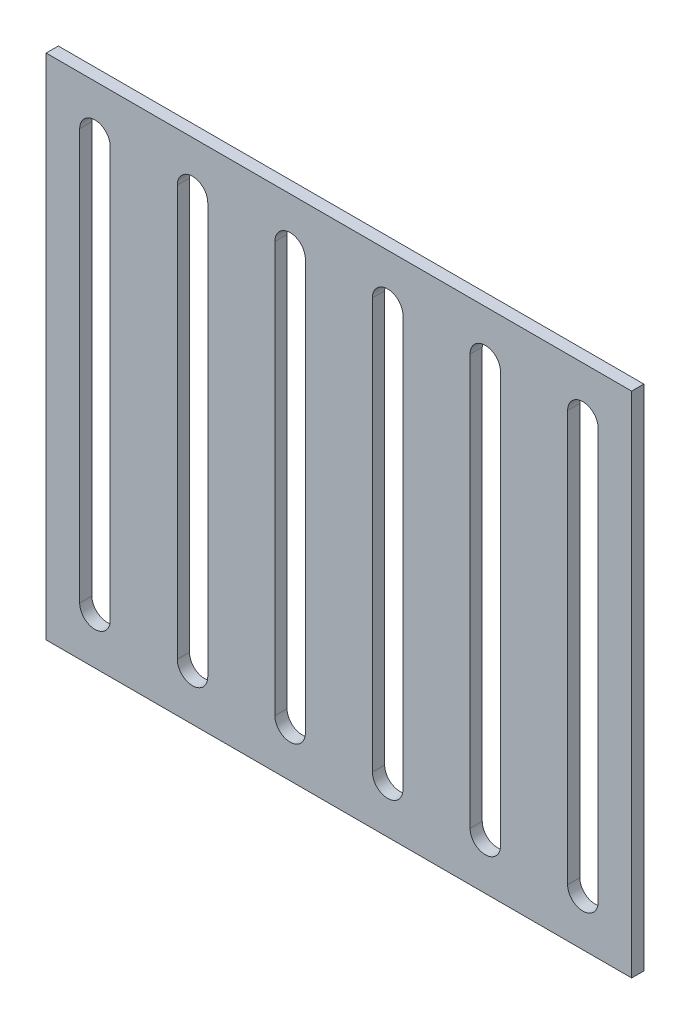
ISO-10303-21;
HEADER;
FILE_DESCRIPTION(('STEP AP214'),'2;1');
FILE_NAME('part.step','',(''),(''),'','','');
FILE_SCHEMA(('AUTOMOTIVE_DESIGN { 1 0 10303 214 1 1 1 1 }'));
ENDSEC;
DATA;
#1=APPLICATION_CONTEXT('core data for automotive mechanical design processes');
#2=APPLICATION_PROTOCOL_DEFINITION('international standard','automotive_design',2000,#1);
#3=PRODUCT_CONTEXT('',#1,'mechanical');
#4=PRODUCT('Part','Part','',(#3));
#5=PRODUCT_RELATED_PRODUCT_CATEGORY('part','',(#4));
#6=PRODUCT_DEFINITION_FORMATION('','',#4);
#7=PRODUCT_DEFINITION_CONTEXT('part definition',#1,'design');
#8=PRODUCT_DEFINITION('design','',#6,#7);
#9=PRODUCT_DEFINITION_SHAPE('','',#8);
#10=(LENGTH_UNIT() NAMED_UNIT(*) SI_UNIT(.MILLI.,.METRE.));
#11=(NAMED_UNIT(*) PLANE_ANGLE_UNIT() SI_UNIT($,.RADIAN.));
#12=(NAMED_UNIT(*) SI_UNIT($,.STERADIAN.) SOLID_ANGLE_UNIT());
#13=UNCERTAINTY_MEASURE_WITH_UNIT(LENGTH_MEASURE(1.E-05),#10,'distance_accuracy_value','');
#14=(GEOMETRIC_REPRESENTATION_CONTEXT(3) GLOBAL_UNCERTAINTY_ASSIGNED_CONTEXT((#13)) GLOBAL_UNIT_ASSIGNED_CONTEXT((#10,
#11,#12)) REPRESENTATION_CONTEXT('',''));
#15=CARTESIAN_POINT('',(0.,0.,0.));
#16=DIRECTION('',(0.,0.,1.));
#17=DIRECTION('',(1.,0.,0.));
#18=AXIS2_PLACEMENT_3D('',#15,#16,#17);
#19=CARTESIAN_POINT('',(271.5,24.,0.));
#20=DIRECTION('',(1.,0.,0.));
#21=DIRECTION('',(0.,1.,0.));
#22=AXIS2_PLACEMENT_3D('',#19,#20,#21);
#23=PLANE('',#22);
#24=DIRECTION('',(0.,1.,0.));
#25=VECTOR('',#24,1.);
#26=CARTESIAN_POINT('',(271.5,24.,6.));
#27=LINE('',#26,#25);
#28=CARTESIAN_POINT('',(271.5,24.,6.));
#29=VERTEX_POINT('',#28);
#30=CARTESIAN_POINT('',(271.5,226.,6.));
#31=VERTEX_POINT('',#30);
#32=EDGE_CURVE('E431',#29,#31,#27,.T.);
#33=ORIENTED_EDGE('',*,*,#32,.T.);
#34=DIRECTION('',(0.,0.,1.));
#35=VECTOR('',#34,1.);
#36=CARTESIAN_POINT('',(271.5,226.,0.));
#37=LINE('',#36,#35);
#38=CARTESIAN_POINT('',(271.5,226.,0.));
#39=VERTEX_POINT('',#38);
#40=EDGE_CURVE('E11',#39,#31,#37,.T.);
#41=ORIENTED_EDGE('',*,*,#40,.F.);
#42=DIRECTION('',(0.,1.,0.));
#43=VECTOR('',#42,1.);
#44=CARTESIAN_POINT('',(271.5,24.,0.));
#45=LINE('',#44,#43);
#46=CARTESIAN_POINT('',(271.5,24.,0.));
#47=VERTEX_POINT('',#46);
#48=EDGE_CURVE('E435',#47,#39,#45,.T.);
#49=ORIENTED_EDGE('',*,*,#48,.F.);
#50=DIRECTION('',(0.,0.,1.));
#51=VECTOR('',#50,1.);
#52=CARTESIAN_POINT('',(271.5,24.,0.));
#53=LINE('',#52,#51);
#54=EDGE_CURVE('E440',#47,#29,#53,.T.);
#55=ORIENTED_EDGE('',*,*,#54,.T.);
#56=EDGE_LOOP('',(#33,#41,#49,#55));
#57=FACE_BOUND('',#56,.T.);
#58=ADVANCED_FACE('F38',(#57),#23,.F.);
#59=CARTESIAN_POINT('',(264.,226.,0.));
#60=DIRECTION('',(0.,0.,1.));
#61=DIRECTION('',(1.,0.,0.));
#62=AXIS2_PLACEMENT_3D('',#59,#60,#61);
#63=CYLINDRICAL_SURFACE('',#62,7.5);
#64=CARTESIAN_POINT('',(264.,226.,6.));
#65=DIRECTION('',(0.,0.,1.));
#66=DIRECTION('',(1.,0.,0.));
#67=AXIS2_PLACEMENT_3D('',#64,#65,#66);
#68=CIRCLE('',#67,7.5);
#69=CARTESIAN_POINT('',(256.5,226.,6.));
#70=VERTEX_POINT('',#69);
#71=EDGE_CURVE('E428',#31,#70,#68,.T.);
#72=ORIENTED_EDGE('',*,*,#71,.T.);
#73=DIRECTION('',(0.,0.,1.));
#74=VECTOR('',#73,1.);
#75=CARTESIAN_POINT('',(256.5,226.,0.));
#76=LINE('',#75,#74);
#77=CARTESIAN_POINT('',(256.5,226.,0.));
#78=VERTEX_POINT('',#77);
#79=EDGE_CURVE('E45',#78,#70,#76,.T.);
#80=ORIENTED_EDGE('',*,*,#79,.F.);
#81=CARTESIAN_POINT('',(264.,226.,0.));
#82=DIRECTION('',(0.,0.,1.));
#83=DIRECTION('',(1.,0.,0.));
#84=AXIS2_PLACEMENT_3D('',#81,#82,#83);
#85=CIRCLE('',#84,7.5);
#86=EDGE_CURVE('E59',#39,#78,#85,.T.);
#87=ORIENTED_EDGE('',*,*,#86,.F.);
#88=ORIENTED_EDGE('',*,*,#40,.T.);
#89=EDGE_LOOP('',(#72,#80,#87,#88));
#90=FACE_BOUND('',#89,.T.);
#91=ADVANCED_FACE('F450',(#90),#63,.F.);
#92=CARTESIAN_POINT('',(256.5,24.,0.));
#93=DIRECTION('',(-1.,0.,0.));
#94=DIRECTION('',(0.,-1.,0.));
#95=AXIS2_PLACEMENT_3D('',#92,#93,#94);
#96=PLANE('',#95);
#97=DIRECTION('',(0.,-1.,0.));
#98=VECTOR('',#97,1.);
#99=CARTESIAN_POINT('',(256.5,24.,6.));
#100=LINE('',#99,#98);
#101=CARTESIAN_POINT('',(256.5,24.,6.));
#102=VERTEX_POINT('',#101);
#103=EDGE_CURVE('E425',#70,#102,#100,.T.);
#104=ORIENTED_EDGE('',*,*,#103,.T.);
#105=DIRECTION('',(0.,0.,1.));
#106=VECTOR('',#105,1.);
#107=CARTESIAN_POINT('',(256.5,24.,0.));
#108=LINE('',#107,#106);
#109=CARTESIAN_POINT('',(256.5,24.,0.));
#110=VERTEX_POINT('',#109);
#111=EDGE_CURVE('E443',#110,#102,#108,.T.);
#112=ORIENTED_EDGE('',*,*,#111,.F.);
#113=DIRECTION('',(0.,-1.,0.));
#114=VECTOR('',#113,1.);
#115=CARTESIAN_POINT('',(256.5,24.,0.));
#116=LINE('',#115,#114);
#117=EDGE_CURVE('E438',#78,#110,#116,.T.);
#118=ORIENTED_EDGE('',*,*,#117,.F.);
#119=ORIENTED_EDGE('',*,*,#79,.T.);
#120=EDGE_LOOP('',(#104,#112,#118,#119));
#121=FACE_BOUND('',#120,.T.);
#122=ADVANCED_FACE('F447',(#121),#96,.F.);
#123=CARTESIAN_POINT('',(264.,24.,0.));
#124=DIRECTION('',(0.,0.,1.));
#125=DIRECTION('',(1.,0.,0.));
#126=AXIS2_PLACEMENT_3D('',#123,#124,#125);
#127=CYLINDRICAL_SURFACE('',#126,7.50000000000003);
#128=CARTESIAN_POINT('',(264.,24.,6.));
#129=DIRECTION('',(0.,0.,1.));
#130=DIRECTION('',(1.,0.,0.));
#131=AXIS2_PLACEMENT_3D('',#128,#129,#130);
#132=CIRCLE('',#131,7.50000000000003);
#133=EDGE_CURVE('E423',#102,#29,#132,.T.);
#134=ORIENTED_EDGE('',*,*,#133,.T.);
#135=ORIENTED_EDGE('',*,*,#54,.F.);
#136=CARTESIAN_POINT('',(264.,24.,0.));
#137=DIRECTION('',(0.,0.,1.));
#138=DIRECTION('',(1.,0.,0.));
#139=AXIS2_PLACEMENT_3D('',#136,#137,#138);
#140=CIRCLE('',#139,7.50000000000003);
#141=EDGE_CURVE('E52',#110,#47,#140,.T.);
#142=ORIENTED_EDGE('',*,*,#141,.F.);
#143=ORIENTED_EDGE('',*,*,#111,.T.);
#144=EDGE_LOOP('',(#134,#135,#142,#143));
#145=FACE_BOUND('',#144,.T.);
#146=ADVANCED_FACE('F456',(#145),#127,.F.);
#147=CARTESIAN_POINT('',(223.5,24.,0.));
#148=DIRECTION('',(1.,0.,0.));
#149=DIRECTION('',(0.,1.,0.));
#150=AXIS2_PLACEMENT_3D('',#147,#148,#149);
#151=PLANE('',#150);
#152=DIRECTION('',(0.,1.,0.));
#153=VECTOR('',#152,1.);
#154=CARTESIAN_POINT('',(223.5,24.,6.));
#155=LINE('',#154,#153);
#156=CARTESIAN_POINT('',(223.5,24.,6.));
#157=VERTEX_POINT('',#156);
#158=CARTESIAN_POINT('',(223.5,226.,6.));
#159=VERTEX_POINT('',#158);
#160=EDGE_CURVE('E399',#157,#159,#155,.T.);
#161=ORIENTED_EDGE('',*,*,#160,.T.);
#162=DIRECTION('',(0.,0.,1.));
#163=VECTOR('',#162,1.);
#164=CARTESIAN_POINT('',(223.5,226.,0.));
#165=LINE('',#164,#163);
#166=CARTESIAN_POINT('',(223.5,226.,0.));
#167=VERTEX_POINT('',#166);
#168=EDGE_CURVE('E420',#167,#159,#165,.T.);
#169=ORIENTED_EDGE('',*,*,#168,.F.);
#170=DIRECTION('',(0.,1.,0.));
#171=VECTOR('',#170,1.);
#172=CARTESIAN_POINT('',(223.5,24.,0.));
#173=LINE('',#172,#171);
#174=CARTESIAN_POINT('',(223.5,24.,0.));
#175=VERTEX_POINT('',#174);
#176=EDGE_CURVE('E404',#175,#167,#173,.T.);
#177=ORIENTED_EDGE('',*,*,#176,.F.);
#178=DIRECTION('',(0.,0.,1.));
#179=VECTOR('',#178,1.);
#180=CARTESIAN_POINT('',(223.5,24.,0.));
#181=LINE('',#180,#179);
#182=EDGE_CURVE('E411',#175,#157,#181,.T.);
#183=ORIENTED_EDGE('',*,*,#182,.T.);
#184=EDGE_LOOP('',(#161,#169,#177,#183));
#185=FACE_BOUND('',#184,.T.);
#186=ADVANCED_FACE('F458',(#185),#151,.F.);
#187=CARTESIAN_POINT('',(216.,226.,0.));
#188=DIRECTION('',(0.,0.,1.));
#189=DIRECTION('',(1.,0.,0.));
#190=AXIS2_PLACEMENT_3D('',#187,#188,#189);
#191=CYLINDRICAL_SURFACE('',#190,7.5);
#192=CARTESIAN_POINT('',(216.,226.,6.));
#193=DIRECTION('',(0.,0.,1.));
#194=DIRECTION('',(1.,0.,0.));
#195=AXIS2_PLACEMENT_3D('',#192,#193,#194);
#196=CIRCLE('',#195,7.5);
#197=CARTESIAN_POINT('',(208.5,226.,6.));
#198=VERTEX_POINT('',#197);
#199=EDGE_CURVE('E396',#159,#198,#196,.T.);
#200=ORIENTED_EDGE('',*,*,#199,.T.);
#201=DIRECTION('',(0.,0.,1.));
#202=VECTOR('',#201,1.);
#203=CARTESIAN_POINT('',(208.5,226.,0.));
#204=LINE('',#203,#202);
#205=CARTESIAN_POINT('',(208.5,226.,0.));
#206=VERTEX_POINT('',#205);
#207=EDGE_CURVE('E417',#206,#198,#204,.T.);
#208=ORIENTED_EDGE('',*,*,#207,.F.);
#209=CARTESIAN_POINT('',(216.,226.,0.));
#210=DIRECTION('',(0.,0.,1.));
#211=DIRECTION('',(1.,0.,0.));
#212=AXIS2_PLACEMENT_3D('',#209,#210,#211);
#213=CIRCLE('',#212,7.5);
#214=EDGE_CURVE('E406',#167,#206,#213,.T.);
#215=ORIENTED_EDGE('',*,*,#214,.F.);
#216=ORIENTED_EDGE('',*,*,#168,.T.);
#217=EDGE_LOOP('',(#200,#208,#215,#216));
#218=FACE_BOUND('',#217,.T.);
#219=ADVANCED_FACE('F464',(#218),#191,.F.);
#220=CARTESIAN_POINT('',(208.5,24.,0.));
#221=DIRECTION('',(-1.,0.,0.));
#222=DIRECTION('',(0.,-1.,0.));
#223=AXIS2_PLACEMENT_3D('',#220,#221,#222);
#224=PLANE('',#223);
#225=DIRECTION('',(0.,-1.,0.));
#226=VECTOR('',#225,1.);
#227=CARTESIAN_POINT('',(208.5,24.,6.));
#228=LINE('',#227,#226);
#229=CARTESIAN_POINT('',(208.5,24.,6.));
#230=VERTEX_POINT('',#229);
#231=EDGE_CURVE('E393',#198,#230,#228,.T.);
#232=ORIENTED_EDGE('',*,*,#231,.T.);
#233=DIRECTION('',(0.,0.,1.));
#234=VECTOR('',#233,1.);
#235=CARTESIAN_POINT('',(208.5,24.,0.));
#236=LINE('',#235,#234);
#237=CARTESIAN_POINT('',(208.5,24.,0.));
#238=VERTEX_POINT('',#237);
#239=EDGE_CURVE('E414',#238,#230,#236,.T.);
#240=ORIENTED_EDGE('',*,*,#239,.F.);
#241=DIRECTION('',(0.,-1.,0.));
#242=VECTOR('',#241,1.);
#243=CARTESIAN_POINT('',(208.5,24.,0.));
#244=LINE('',#243,#242);
#245=EDGE_CURVE('E408',#206,#238,#244,.T.);
#246=ORIENTED_EDGE('',*,*,#245,.F.);
#247=ORIENTED_EDGE('',*,*,#207,.T.);
#248=EDGE_LOOP('',(#232,#240,#246,#247));
#249=FACE_BOUND('',#248,.T.);
#250=ADVANCED_FACE('F611',(#249),#224,.F.);
#251=CARTESIAN_POINT('',(216.,24.,0.));
#252=DIRECTION('',(0.,0.,1.));
#253=DIRECTION('',(1.,0.,0.));
#254=AXIS2_PLACEMENT_3D('',#251,#252,#253);
#255=CYLINDRICAL_SURFACE('',#254,7.50000000000003);
#256=CARTESIAN_POINT('',(216.,24.,6.));
#257=DIRECTION('',(0.,0.,1.));
#258=DIRECTION('',(1.,0.,0.));
#259=AXIS2_PLACEMENT_3D('',#256,#257,#258);
#260=CIRCLE('',#259,7.50000000000003);
#261=EDGE_CURVE('E391',#230,#157,#260,.T.);
#262=ORIENTED_EDGE('',*,*,#261,.T.);
#263=ORIENTED_EDGE('',*,*,#182,.F.);
#264=CARTESIAN_POINT('',(216.,24.,0.));
#265=DIRECTION('',(0.,0.,1.));
#266=DIRECTION('',(1.,0.,0.));
#267=AXIS2_PLACEMENT_3D('',#264,#265,#266);
#268=CIRCLE('',#267,7.50000000000003);
#269=EDGE_CURVE('E402',#238,#175,#268,.T.);
#270=ORIENTED_EDGE('',*,*,#269,.F.);
#271=ORIENTED_EDGE('',*,*,#239,.T.);
#272=EDGE_LOOP('',(#262,#263,#270,#271));
#273=FACE_BOUND('',#272,.T.);
#274=ADVANCED_FACE('F485',(#273),#255,.F.);
#275=CARTESIAN_POINT('',(175.5,24.,0.));
#276=DIRECTION('',(1.,0.,0.));
#277=DIRECTION('',(0.,1.,0.));
#278=AXIS2_PLACEMENT_3D('',#275,#276,#277);
#279=PLANE('',#278);
#280=DIRECTION('',(0.,1.,0.));
#281=VECTOR('',#280,1.);
#282=CARTESIAN_POINT('',(175.5,24.,6.));
#283=LINE('',#282,#281);
#284=CARTESIAN_POINT('',(175.5,24.,6.));
#285=VERTEX_POINT('',#284);
#286=CARTESIAN_POINT('',(175.5,226.,6.));
#287=VERTEX_POINT('',#286);
#288=EDGE_CURVE('E367',#285,#287,#283,.T.);
#289=ORIENTED_EDGE('',*,*,#288,.T.);
#290=DIRECTION('',(0.,0.,1.));
#291=VECTOR('',#290,1.);
#292=CARTESIAN_POINT('',(175.5,226.,0.));
#293=LINE('',#292,#291);
#294=CARTESIAN_POINT('',(175.5,226.,0.));
#295=VERTEX_POINT('',#294);
#296=EDGE_CURVE('E388',#295,#287,#293,.T.);
#297=ORIENTED_EDGE('',*,*,#296,.F.);
#298=DIRECTION('',(0.,1.,0.));
#299=VECTOR('',#298,1.);
#300=CARTESIAN_POINT('',(175.5,24.,0.));
#301=LINE('',#300,#299);
#302=CARTESIAN_POINT('',(175.5,24.,0.));
#303=VERTEX_POINT('',#302);
#304=EDGE_CURVE('E372',#303,#295,#301,.T.);
#305=ORIENTED_EDGE('',*,*,#304,.F.);
#306=DIRECTION('',(0.,0.,1.));
#307=VECTOR('',#306,1.);
#308=CARTESIAN_POINT('',(175.5,24.,0.));
#309=LINE('',#308,#307);
#310=EDGE_CURVE('E379',#303,#285,#309,.T.);
#311=ORIENTED_EDGE('',*,*,#310,.T.);
#312=EDGE_LOOP('',(#289,#297,#305,#311));
#313=FACE_BOUND('',#312,.T.);
#314=ADVANCED_FACE('F597',(#313),#279,.F.);
#315=CARTESIAN_POINT('',(168.,226.,0.));
#316=DIRECTION('',(0.,0.,1.));
#317=DIRECTION('',(1.,0.,0.));
#318=AXIS2_PLACEMENT_3D('',#315,#316,#317);
#319=CYLINDRICAL_SURFACE('',#318,7.5);
#320=CARTESIAN_POINT('',(168.,226.,6.));
#321=DIRECTION('',(0.,0.,1.));
#322=DIRECTION('',(1.,0.,0.));
#323=AXIS2_PLACEMENT_3D('',#320,#321,#322);
#324=CIRCLE('',#323,7.5);
#325=CARTESIAN_POINT('',(160.5,226.,6.));
#326=VERTEX_POINT('',#325);
#327=EDGE_CURVE('E364',#287,#326,#324,.T.);
#328=ORIENTED_EDGE('',*,*,#327,.T.);
#329=DIRECTION('',(0.,0.,1.));
#330=VECTOR('',#329,1.);
#331=CARTESIAN_POINT('',(160.5,226.,0.));
#332=LINE('',#331,#330);
#333=CARTESIAN_POINT('',(160.5,226.,0.));
#334=VERTEX_POINT('',#333);
#335=EDGE_CURVE('E385',#334,#326,#332,.T.);
#336=ORIENTED_EDGE('',*,*,#335,.F.);
#337=CARTESIAN_POINT('',(168.,226.,0.));
#338=DIRECTION('',(0.,0.,1.));
#339=DIRECTION('',(1.,0.,0.));
#340=AXIS2_PLACEMENT_3D('',#337,#338,#339);
#341=CIRCLE('',#340,7.5);
#342=EDGE_CURVE('E374',#295,#334,#341,.T.);
#343=ORIENTED_EDGE('',*,*,#342,.F.);
#344=ORIENTED_EDGE('',*,*,#296,.T.);
#345=EDGE_LOOP('',(#328,#336,#343,#344));
#346=FACE_BOUND('',#345,.T.);
#347=ADVANCED_FACE('F590',(#346),#319,.F.);
#348=CARTESIAN_POINT('',(160.5,24.,0.));
#349=DIRECTION('',(-1.,0.,0.));
#350=DIRECTION('',(0.,-1.,0.));
#351=AXIS2_PLACEMENT_3D('',#348,#349,#350);
#352=PLANE('',#351);
#353=DIRECTION('',(0.,-1.,0.));
#354=VECTOR('',#353,1.);
#355=CARTESIAN_POINT('',(160.5,24.,6.));
#356=LINE('',#355,#354);
#357=CARTESIAN_POINT('',(160.5,24.,6.));
#358=VERTEX_POINT('',#357);
#359=EDGE_CURVE('E361',#326,#358,#356,.T.);
#360=ORIENTED_EDGE('',*,*,#359,.T.);
#361=DIRECTION('',(0.,0.,1.));
#362=VECTOR('',#361,1.);
#363=CARTESIAN_POINT('',(160.5,24.,0.));
#364=LINE('',#363,#362);
#365=CARTESIAN_POINT('',(160.5,24.,0.));
#366=VERTEX_POINT('',#365);
#367=EDGE_CURVE('E382',#366,#358,#364,.T.);
#368=ORIENTED_EDGE('',*,*,#367,.F.);
#369=DIRECTION('',(0.,-1.,0.));
#370=VECTOR('',#369,1.);
#371=CARTESIAN_POINT('',(160.5,24.,0.));
#372=LINE('',#371,#370);
#373=EDGE_CURVE('E376',#334,#366,#372,.T.);
#374=ORIENTED_EDGE('',*,*,#373,.F.);
#375=ORIENTED_EDGE('',*,*,#335,.T.);
#376=EDGE_LOOP('',(#360,#368,#374,#375));
#377=FACE_BOUND('',#376,.T.);
#378=ADVANCED_FACE('F583',(#377),#352,.F.);
#379=CARTESIAN_POINT('',(168.,24.,0.));
#380=DIRECTION('',(0.,0.,1.));
#381=DIRECTION('',(1.,0.,0.));
#382=AXIS2_PLACEMENT_3D('',#379,#380,#381);
#383=CYLINDRICAL_SURFACE('',#382,7.50000000000003);
#384=CARTESIAN_POINT('',(168.,24.,6.));
#385=DIRECTION('',(0.,0.,1.));
#386=DIRECTION('',(1.,0.,0.));
#387=AXIS2_PLACEMENT_3D('',#384,#385,#386);
#388=CIRCLE('',#387,7.50000000000003);
#389=EDGE_CURVE('E359',#358,#285,#388,.T.);
#390=ORIENTED_EDGE('',*,*,#389,.T.);
#391=ORIENTED_EDGE('',*,*,#310,.F.);
#392=CARTESIAN_POINT('',(168.,24.,0.));
#393=DIRECTION('',(0.,0.,1.));
#394=DIRECTION('',(1.,0.,0.));
#395=AXIS2_PLACEMENT_3D('',#392,#393,#394);
#396=CIRCLE('',#395,7.50000000000003);
#397=EDGE_CURVE('E370',#366,#303,#396,.T.);
#398=ORIENTED_EDGE('',*,*,#397,.F.);
#399=ORIENTED_EDGE('',*,*,#367,.T.);
#400=EDGE_LOOP('',(#390,#391,#398,#399));
#401=FACE_BOUND('',#400,.T.);
#402=ADVANCED_FACE('F574',(#401),#383,.F.);
#403=CARTESIAN_POINT('',(127.5,24.,0.));
#404=DIRECTION('',(1.,0.,0.));
#405=DIRECTION('',(0.,1.,0.));
#406=AXIS2_PLACEMENT_3D('',#403,#404,#405);
#407=PLANE('',#406);
#408=DIRECTION('',(0.,1.,0.));
#409=VECTOR('',#408,1.);
#410=CARTESIAN_POINT('',(127.5,24.,6.));
#411=LINE('',#410,#409);
#412=CARTESIAN_POINT('',(127.5,24.,6.));
#413=VERTEX_POINT('',#412);
#414=CARTESIAN_POINT('',(127.5,226.,6.));
#415=VERTEX_POINT('',#414);
#416=EDGE_CURVE('E335',#413,#415,#411,.T.);
#417=ORIENTED_EDGE('',*,*,#416,.T.);
#418=DIRECTION('',(0.,0.,1.));
#419=VECTOR('',#418,1.);
#420=CARTESIAN_POINT('',(127.5,226.,0.));
#421=LINE('',#420,#419);
#422=CARTESIAN_POINT('',(127.5,226.,0.));
#423=VERTEX_POINT('',#422);
#424=EDGE_CURVE('E356',#423,#415,#421,.T.);
#425=ORIENTED_EDGE('',*,*,#424,.F.);
#426=DIRECTION('',(0.,1.,0.));
#427=VECTOR('',#426,1.);
#428=CARTESIAN_POINT('',(127.5,24.,0.));
#429=LINE('',#428,#427);
#430=CARTESIAN_POINT('',(127.5,24.,0.));
#431=VERTEX_POINT('',#430);
#432=EDGE_CURVE('E340',#431,#423,#429,.T.);
#433=ORIENTED_EDGE('',*,*,#432,.F.);
#434=DIRECTION('',(0.,0.,1.));
#435=VECTOR('',#434,1.);
#436=CARTESIAN_POINT('',(127.5,24.,0.));
#437=LINE('',#436,#435);
#438=EDGE_CURVE('E347',#431,#413,#437,.T.);
#439=ORIENTED_EDGE('',*,*,#438,.T.);
#440=EDGE_LOOP('',(#417,#425,#433,#439));
#441=FACE_BOUND('',#440,.T.);
#442=ADVANCED_FACE('F565',(#441),#407,.F.);
#443=CARTESIAN_POINT('',(120.,226.,0.));
#444=DIRECTION('',(0.,0.,1.));
#445=DIRECTION('',(1.,0.,0.));
#446=AXIS2_PLACEMENT_3D('',#443,#444,#445);
#447=CYLINDRICAL_SURFACE('',#446,7.5);
#448=CARTESIAN_POINT('',(120.,226.,6.));
#449=DIRECTION('',(0.,0.,1.));
#450=DIRECTION('',(1.,0.,0.));
#451=AXIS2_PLACEMENT_3D('',#448,#449,#450);
#452=CIRCLE('',#451,7.5);
#453=CARTESIAN_POINT('',(112.5,226.,6.));
#454=VERTEX_POINT('',#453);
#455=EDGE_CURVE('E332',#415,#454,#452,.T.);
#456=ORIENTED_EDGE('',*,*,#455,.T.);
#457=DIRECTION('',(0.,0.,1.));
#458=VECTOR('',#457,1.);
#459=CARTESIAN_POINT('',(112.5,226.,0.));
#460=LINE('',#459,#458);
#461=CARTESIAN_POINT('',(112.5,226.,0.));
#462=VERTEX_POINT('',#461);
#463=EDGE_CURVE('E353',#462,#454,#460,.T.);
#464=ORIENTED_EDGE('',*,*,#463,.F.);
#465=CARTESIAN_POINT('',(120.,226.,0.));
#466=DIRECTION('',(0.,0.,1.));
#467=DIRECTION('',(1.,0.,0.));
#468=AXIS2_PLACEMENT_3D('',#465,#466,#467);
#469=CIRCLE('',#468,7.5);
#470=EDGE_CURVE('E342',#423,#462,#469,.T.);
#471=ORIENTED_EDGE('',*,*,#470,.F.);
#472=ORIENTED_EDGE('',*,*,#424,.T.);
#473=EDGE_LOOP('',(#456,#464,#471,#472));
#474=FACE_BOUND('',#473,.T.);
#475=ADVANCED_FACE('F555',(#474),#447,.F.);
#476=CARTESIAN_POINT('',(112.5,24.,0.));
#477=DIRECTION('',(-1.,0.,0.));
#478=DIRECTION('',(0.,-1.,0.));
#479=AXIS2_PLACEMENT_3D('',#476,#477,#478);
#480=PLANE('',#479);
#481=DIRECTION('',(0.,-1.,0.));
#482=VECTOR('',#481,1.);
#483=CARTESIAN_POINT('',(112.5,24.,6.));
#484=LINE('',#483,#482);
#485=CARTESIAN_POINT('',(112.5,24.,6.));
#486=VERTEX_POINT('',#485);
#487=EDGE_CURVE('E329',#454,#486,#484,.T.);
#488=ORIENTED_EDGE('',*,*,#487,.T.);
#489=DIRECTION('',(0.,0.,1.));
#490=VECTOR('',#489,1.);
#491=CARTESIAN_POINT('',(112.5,24.,0.));
#492=LINE('',#491,#490);
#493=CARTESIAN_POINT('',(112.5,24.,0.));
#494=VERTEX_POINT('',#493);
#495=EDGE_CURVE('E350',#494,#486,#492,.T.);
#496=ORIENTED_EDGE('',*,*,#495,.F.);
#497=DIRECTION('',(0.,-1.,0.));
#498=VECTOR('',#497,1.);
#499=CARTESIAN_POINT('',(112.5,24.,0.));
#500=LINE('',#499,#498);
#501=EDGE_CURVE('E344',#462,#494,#500,.T.);
#502=ORIENTED_EDGE('',*,*,#501,.F.);
#503=ORIENTED_EDGE('',*,*,#463,.T.);
#504=EDGE_LOOP('',(#488,#496,#502,#503));
#505=FACE_BOUND('',#504,.T.);
#506=ADVANCED_FACE('F546',(#505),#480,.F.);
#507=CARTESIAN_POINT('',(120.,24.,0.));
#508=DIRECTION('',(0.,0.,1.));
#509=DIRECTION('',(1.,0.,0.));
#510=AXIS2_PLACEMENT_3D('',#507,#508,#509);
#511=CYLINDRICAL_SURFACE('',#510,7.50000000000003);
#512=CARTESIAN_POINT('',(120.,24.,6.));
#513=DIRECTION('',(0.,0.,1.));
#514=DIRECTION('',(1.,0.,0.));
#515=AXIS2_PLACEMENT_3D('',#512,#513,#514);
#516=CIRCLE('',#515,7.50000000000003);
#517=EDGE_CURVE('E327',#486,#413,#516,.T.);
#518=ORIENTED_EDGE('',*,*,#517,.T.);
#519=ORIENTED_EDGE('',*,*,#438,.F.);
#520=CARTESIAN_POINT('',(120.,24.,0.));
#521=DIRECTION('',(0.,0.,1.));
#522=DIRECTION('',(1.,0.,0.));
#523=AXIS2_PLACEMENT_3D('',#520,#521,#522);
#524=CIRCLE('',#523,7.50000000000003);
#525=EDGE_CURVE('E338',#494,#431,#524,.T.);
#526=ORIENTED_EDGE('',*,*,#525,.F.);
#527=ORIENTED_EDGE('',*,*,#495,.T.);
#528=EDGE_LOOP('',(#518,#519,#526,#527));
#529=FACE_BOUND('',#528,.T.);
#530=ADVANCED_FACE('F538',(#529),#511,.F.);
#531=CARTESIAN_POINT('',(0.,0.,6.));
#532=DIRECTION('',(1.,0.,0.));
#533=DIRECTION('',(0.,0.,-1.));
#534=AXIS2_PLACEMENT_3D('',#531,#532,#533);
#535=PLANE('',#534);
#536=DIRECTION('',(0.,-1.,0.));
#537=VECTOR('',#536,1.);
#538=CARTESIAN_POINT('',(0.,0.,0.));
#539=LINE('',#538,#537);
#540=CARTESIAN_POINT('',(0.,250.,0.));
#541=VERTEX_POINT('',#540);
#542=CARTESIAN_POINT('',(0.,0.,0.));
#543=VERTEX_POINT('',#542);
#544=EDGE_CURVE('E291',#541,#543,#539,.T.);
#545=ORIENTED_EDGE('',*,*,#544,.T.);
#546=DIRECTION('',(0.,0.,-1.));
#547=VECTOR('',#546,1.);
#548=CARTESIAN_POINT('',(0.,0.,6.));
#549=LINE('',#548,#547);
#550=CARTESIAN_POINT('',(0.,0.,6.));
#551=VERTEX_POINT('',#550);
#552=EDGE_CURVE('E324',#551,#543,#549,.T.);
#553=ORIENTED_EDGE('',*,*,#552,.F.);
#554=DIRECTION('',(0.,-1.,0.));
#555=VECTOR('',#554,1.);
#556=CARTESIAN_POINT('',(0.,0.,6.));
#557=LINE('',#556,#555);
#558=CARTESIAN_POINT('',(0.,250.,6.));
#559=VERTEX_POINT('',#558);
#560=EDGE_CURVE('E298',#559,#551,#557,.T.);
#561=ORIENTED_EDGE('',*,*,#560,.F.);
#562=DIRECTION('',(0.,0.,-1.));
#563=VECTOR('',#562,1.);
#564=CARTESIAN_POINT('',(0.,250.,6.));
#565=LINE('',#564,#563);
#566=EDGE_CURVE('E308',#559,#541,#565,.T.);
#567=ORIENTED_EDGE('',*,*,#566,.T.);
#568=EDGE_LOOP('',(#545,#553,#561,#567));
#569=FACE_BOUND('',#568,.T.);
#570=ADVANCED_FACE('F530',(#569),#535,.F.);
#571=CARTESIAN_POINT('',(0.,0.,6.));
#572=DIRECTION('',(0.,1.,0.));
#573=DIRECTION('',(0.,0.,1.));
#574=AXIS2_PLACEMENT_3D('',#571,#572,#573);
#575=PLANE('',#574);
#576=DIRECTION('',(1.,0.,0.));
#577=VECTOR('',#576,1.);
#578=CARTESIAN_POINT('',(0.,0.,0.));
#579=LINE('',#578,#577);
#580=CARTESIAN_POINT('',(288.,0.,0.));
#581=VERTEX_POINT('',#580);
#582=EDGE_CURVE('E311',#543,#581,#579,.T.);
#583=ORIENTED_EDGE('',*,*,#582,.T.);
#584=DIRECTION('',(0.,0.,-1.));
#585=VECTOR('',#584,1.);
#586=CARTESIAN_POINT('',(288.,0.,6.));
#587=LINE('',#586,#585);
#588=CARTESIAN_POINT('',(288.,0.,6.));
#589=VERTEX_POINT('',#588);
#590=EDGE_CURVE('E321',#589,#581,#587,.T.);
#591=ORIENTED_EDGE('',*,*,#590,.F.);
#592=DIRECTION('',(1.,0.,0.));
#593=VECTOR('',#592,1.);
#594=CARTESIAN_POINT('',(0.,0.,6.));
#595=LINE('',#594,#593);
#596=EDGE_CURVE('E301',#551,#589,#595,.T.);
#597=ORIENTED_EDGE('',*,*,#596,.F.);
#598=ORIENTED_EDGE('',*,*,#552,.T.);
#599=EDGE_LOOP('',(#583,#591,#597,#598));
#600=FACE_BOUND('',#599,.T.);
#601=ADVANCED_FACE('F522',(#600),#575,.F.);
#602=CARTESIAN_POINT('',(288.,0.,6.));
#603=DIRECTION('',(-1.,0.,0.));
#604=DIRECTION('',(0.,0.,1.));
#605=AXIS2_PLACEMENT_3D('',#602,#603,#604);
#606=PLANE('',#605);
#607=DIRECTION('',(0.,1.,0.));
#608=VECTOR('',#607,1.);
#609=CARTESIAN_POINT('',(288.,0.,0.));
#610=LINE('',#609,#608);
#611=CARTESIAN_POINT('',(288.,250.,0.));
#612=VERTEX_POINT('',#611);
#613=EDGE_CURVE('E313',#581,#612,#610,.T.);
#614=ORIENTED_EDGE('',*,*,#613,.T.);
#615=DIRECTION('',(0.,0.,-1.));
#616=VECTOR('',#615,1.);
#617=CARTESIAN_POINT('',(288.,250.,6.));
#618=LINE('',#617,#616);
#619=CARTESIAN_POINT('',(288.,250.,6.));
#620=VERTEX_POINT('',#619);
#621=EDGE_CURVE('E318',#620,#612,#618,.T.);
#622=ORIENTED_EDGE('',*,*,#621,.F.);
#623=DIRECTION('',(0.,1.,0.));
#624=VECTOR('',#623,1.);
#625=CARTESIAN_POINT('',(288.,0.,6.));
#626=LINE('',#625,#624);
#627=EDGE_CURVE('E304',#589,#620,#626,.T.);
#628=ORIENTED_EDGE('',*,*,#627,.F.);
#629=ORIENTED_EDGE('',*,*,#590,.T.);
#630=EDGE_LOOP('',(#614,#622,#628,#629));
#631=FACE_BOUND('',#630,.T.);
#632=ADVANCED_FACE('F511',(#631),#606,.F.);
#633=CARTESIAN_POINT('',(0.,250.,6.));
#634=DIRECTION('',(0.,-1.,0.));
#635=DIRECTION('',(0.,0.,-1.));
#636=AXIS2_PLACEMENT_3D('',#633,#634,#635);
#637=PLANE('',#636);
#638=DIRECTION('',(-1.,0.,0.));
#639=VECTOR('',#638,1.);
#640=CARTESIAN_POINT('',(0.,250.,0.));
#641=LINE('',#640,#639);
#642=EDGE_CURVE('E302',#612,#541,#641,.T.);
#643=ORIENTED_EDGE('',*,*,#642,.T.);
#644=ORIENTED_EDGE('',*,*,#566,.F.);
#645=DIRECTION('',(-1.,0.,0.));
#646=VECTOR('',#645,1.);
#647=CARTESIAN_POINT('',(0.,250.,6.));
#648=LINE('',#647,#646);
#649=EDGE_CURVE('E306',#620,#559,#648,.T.);
#650=ORIENTED_EDGE('',*,*,#649,.F.);
#651=ORIENTED_EDGE('',*,*,#621,.T.);
#652=EDGE_LOOP('',(#643,#644,#650,#651));
#653=FACE_BOUND('',#652,.T.);
#654=ADVANCED_FACE('F500',(#653),#637,.F.);
#655=CARTESIAN_POINT('',(0.,0.,6.));
#656=DIRECTION('',(0.,0.,-1.));
#657=DIRECTION('',(-1.,0.,0.));
#658=AXIS2_PLACEMENT_3D('',#655,#656,#657);
#659=PLANE('',#658);
#660=DIRECTION('',(0.,1.,0.));
#661=VECTOR('',#660,1.);
#662=CARTESIAN_POINT('',(79.5,24.,6.));
#663=LINE('',#662,#661);
#664=CARTESIAN_POINT('',(79.5,24.,6.));
#665=VERTEX_POINT('',#664);
#666=CARTESIAN_POINT('',(79.5,226.,6.));
#667=VERTEX_POINT('',#666);
#668=EDGE_CURVE('E224',#665,#667,#663,.T.);
#669=ORIENTED_EDGE('',*,*,#668,.F.);
#670=CARTESIAN_POINT('',(72.,24.,6.));
#671=DIRECTION('',(0.,0.,1.));
#672=DIRECTION('',(1.,0.,0.));
#673=AXIS2_PLACEMENT_3D('',#670,#671,#672);
#674=CIRCLE('',#673,7.50000000000003);
#675=CARTESIAN_POINT('',(64.5,24.,6.));
#676=VERTEX_POINT('',#675);
#677=EDGE_CURVE('E260',#676,#665,#674,.T.);
#678=ORIENTED_EDGE('',*,*,#677,.F.);
#679=DIRECTION('',(0.,-1.,0.));
#680=VECTOR('',#679,1.);
#681=CARTESIAN_POINT('',(64.5,24.,6.));
#682=LINE('',#681,#680);
#683=CARTESIAN_POINT('',(64.5,226.,6.));
#684=VERTEX_POINT('',#683);
#685=EDGE_CURVE('E246',#684,#676,#682,.T.);
#686=ORIENTED_EDGE('',*,*,#685,.F.);
#687=CARTESIAN_POINT('',(72.,226.,6.));
#688=DIRECTION('',(0.,0.,1.));
#689=DIRECTION('',(1.,0.,0.));
#690=AXIS2_PLACEMENT_3D('',#687,#688,#689);
#691=CIRCLE('',#690,7.5);
#692=EDGE_CURVE('E238',#667,#684,#691,.T.);
#693=ORIENTED_EDGE('',*,*,#692,.F.);
#694=EDGE_LOOP('',(#669,#678,#686,#693));
#695=FACE_BOUND('',#694,.T.);
#696=DIRECTION('',(0.,1.,0.));
#697=VECTOR('',#696,1.);
#698=CARTESIAN_POINT('',(31.5,24.,6.));
#699=LINE('',#698,#697);
#700=CARTESIAN_POINT('',(31.5,24.,6.));
#701=VERTEX_POINT('',#700);
#702=CARTESIAN_POINT('',(31.5,226.,6.));
#703=VERTEX_POINT('',#702);
#704=EDGE_CURVE('E281',#701,#703,#699,.T.);
#705=ORIENTED_EDGE('',*,*,#704,.F.);
#706=CARTESIAN_POINT('',(24.,24.,6.));
#707=DIRECTION('',(0.,0.,1.));
#708=DIRECTION('',(1.,0.,0.));
#709=AXIS2_PLACEMENT_3D('',#706,#707,#708);
#710=CIRCLE('',#709,7.50000000000003);
#711=CARTESIAN_POINT('',(16.5,24.,6.));
#712=VERTEX_POINT('',#711);
#713=EDGE_CURVE('E265',#712,#701,#710,.T.);
#714=ORIENTED_EDGE('',*,*,#713,.F.);
#715=DIRECTION('',(0.,-1.,0.));
#716=VECTOR('',#715,1.);
#717=CARTESIAN_POINT('',(16.5,24.,6.));
#718=LINE('',#717,#716);
#719=CARTESIAN_POINT('',(16.5,226.,6.));
#720=VERTEX_POINT('',#719);
#721=EDGE_CURVE('E270',#720,#712,#718,.T.);
#722=ORIENTED_EDGE('',*,*,#721,.F.);
#723=CARTESIAN_POINT('',(24.,226.,6.));
#724=DIRECTION('',(0.,0.,1.));
#725=DIRECTION('',(1.,0.,0.));
#726=AXIS2_PLACEMENT_3D('',#723,#724,#725);
#727=CIRCLE('',#726,7.5);
#728=EDGE_CURVE('E284',#703,#720,#727,.T.);
#729=ORIENTED_EDGE('',*,*,#728,.F.);
#730=EDGE_LOOP('',(#705,#714,#722,#729));
#731=FACE_BOUND('',#730,.T.);
#732=ORIENTED_EDGE('',*,*,#560,.T.);
#733=ORIENTED_EDGE('',*,*,#596,.T.);
#734=ORIENTED_EDGE('',*,*,#627,.T.);
#735=ORIENTED_EDGE('',*,*,#649,.T.);
#736=EDGE_LOOP('',(#732,#733,#734,#735));
#737=FACE_BOUND('',#736,.T.);
#738=ORIENTED_EDGE('',*,*,#517,.F.);
#739=ORIENTED_EDGE('',*,*,#487,.F.);
#740=ORIENTED_EDGE('',*,*,#455,.F.);
#741=ORIENTED_EDGE('',*,*,#416,.F.);
#742=EDGE_LOOP('',(#738,#739,#740,#741));
#743=FACE_BOUND('',#742,.T.);
#744=ORIENTED_EDGE('',*,*,#389,.F.);
#745=ORIENTED_EDGE('',*,*,#359,.F.);
#746=ORIENTED_EDGE('',*,*,#327,.F.);
#747=ORIENTED_EDGE('',*,*,#288,.F.);
#748=EDGE_LOOP('',(#744,#745,#746,#747));
#749=FACE_BOUND('',#748,.T.);
#750=ORIENTED_EDGE('',*,*,#261,.F.);
#751=ORIENTED_EDGE('',*,*,#231,.F.);
#752=ORIENTED_EDGE('',*,*,#199,.F.);
#753=ORIENTED_EDGE('',*,*,#160,.F.);
#754=EDGE_LOOP('',(#750,#751,#752,#753));
#755=FACE_BOUND('',#754,.T.);
#756=ORIENTED_EDGE('',*,*,#133,.F.);
#757=ORIENTED_EDGE('',*,*,#103,.F.);
#758=ORIENTED_EDGE('',*,*,#71,.F.);
#759=ORIENTED_EDGE('',*,*,#32,.F.);
#760=EDGE_LOOP('',(#756,#757,#758,#759));
#761=FACE_BOUND('',#760,.T.);
#762=ADVANCED_FACE('F244',(#695,#731,#737,#743,#749,#755,#761),#659,.F.);
#763=CARTESIAN_POINT('',(0.,0.,0.));
#764=DIRECTION('',(0.,0.,-1.));
#765=DIRECTION('',(-1.,0.,0.));
#766=AXIS2_PLACEMENT_3D('',#763,#764,#765);
#767=PLANE('',#766);
#768=CARTESIAN_POINT('',(72.,24.,0.));
#769=DIRECTION('',(0.,0.,1.));
#770=DIRECTION('',(1.,0.,0.));
#771=AXIS2_PLACEMENT_3D('',#768,#769,#770);
#772=CIRCLE('',#771,7.50000000000003);
#773=CARTESIAN_POINT('',(64.5,24.,0.));
#774=VERTEX_POINT('',#773);
#775=CARTESIAN_POINT('',(79.5,24.,0.));
#776=VERTEX_POINT('',#775);
#777=EDGE_CURVE('E262',#774,#776,#772,.T.);
#778=ORIENTED_EDGE('',*,*,#777,.T.);
#779=DIRECTION('',(0.,1.,0.));
#780=VECTOR('',#779,1.);
#781=CARTESIAN_POINT('',(79.5,24.,0.));
#782=LINE('',#781,#780);
#783=CARTESIAN_POINT('',(79.5,226.,0.));
#784=VERTEX_POINT('',#783);
#785=EDGE_CURVE('E234',#776,#784,#782,.T.);
#786=ORIENTED_EDGE('',*,*,#785,.T.);
#787=CARTESIAN_POINT('',(72.,226.,0.));
#788=DIRECTION('',(0.,0.,1.));
#789=DIRECTION('',(1.,0.,0.));
#790=AXIS2_PLACEMENT_3D('',#787,#788,#789);
#791=CIRCLE('',#790,7.5);
#792=CARTESIAN_POINT('',(64.5,226.,0.));
#793=VERTEX_POINT('',#792);
#794=EDGE_CURVE('E241',#784,#793,#791,.T.);
#795=ORIENTED_EDGE('',*,*,#794,.T.);
#796=DIRECTION('',(0.,-1.,0.));
#797=VECTOR('',#796,1.);
#798=CARTESIAN_POINT('',(64.5,24.,0.));
#799=LINE('',#798,#797);
#800=EDGE_CURVE('E257',#793,#774,#799,.T.);
#801=ORIENTED_EDGE('',*,*,#800,.T.);
#802=EDGE_LOOP('',(#778,#786,#795,#801));
#803=FACE_BOUND('',#802,.T.);
#804=CARTESIAN_POINT('',(24.,24.,0.));
#805=DIRECTION('',(0.,0.,1.));
#806=DIRECTION('',(1.,0.,0.));
#807=AXIS2_PLACEMENT_3D('',#804,#805,#806);
#808=CIRCLE('',#807,7.50000000000003);
#809=CARTESIAN_POINT('',(16.5,24.,0.));
#810=VERTEX_POINT('',#809);
#811=CARTESIAN_POINT('',(31.5,24.,0.));
#812=VERTEX_POINT('',#811);
#813=EDGE_CURVE('E266',#810,#812,#808,.T.);
#814=ORIENTED_EDGE('',*,*,#813,.T.);
#815=DIRECTION('',(0.,1.,0.));
#816=VECTOR('',#815,1.);
#817=CARTESIAN_POINT('',(31.5,24.,0.));
#818=LINE('',#817,#816);
#819=CARTESIAN_POINT('',(31.5,226.,0.));
#820=VERTEX_POINT('',#819);
#821=EDGE_CURVE('E269',#812,#820,#818,.T.);
#822=ORIENTED_EDGE('',*,*,#821,.T.);
#823=CARTESIAN_POINT('',(24.,226.,0.));
#824=DIRECTION('',(0.,0.,1.));
#825=DIRECTION('',(1.,0.,0.));
#826=AXIS2_PLACEMENT_3D('',#823,#824,#825);
#827=CIRCLE('',#826,7.5);
#828=CARTESIAN_POINT('',(16.5,226.,0.));
#829=VERTEX_POINT('',#828);
#830=EDGE_CURVE('E273',#820,#829,#827,.T.);
#831=ORIENTED_EDGE('',*,*,#830,.T.);
#832=DIRECTION('',(0.,-1.,0.));
#833=VECTOR('',#832,1.);
#834=CARTESIAN_POINT('',(16.5,24.,0.));
#835=LINE('',#834,#833);
#836=EDGE_CURVE('E276',#829,#810,#835,.T.);
#837=ORIENTED_EDGE('',*,*,#836,.T.);
#838=EDGE_LOOP('',(#814,#822,#831,#837));
#839=FACE_BOUND('',#838,.T.);
#840=ORIENTED_EDGE('',*,*,#544,.F.);
#841=ORIENTED_EDGE('',*,*,#642,.F.);
#842=ORIENTED_EDGE('',*,*,#613,.F.);
#843=ORIENTED_EDGE('',*,*,#582,.F.);
#844=EDGE_LOOP('',(#840,#841,#842,#843));
#845=FACE_BOUND('',#844,.T.);
#846=ORIENTED_EDGE('',*,*,#525,.T.);
#847=ORIENTED_EDGE('',*,*,#432,.T.);
#848=ORIENTED_EDGE('',*,*,#470,.T.);
#849=ORIENTED_EDGE('',*,*,#501,.T.);
#850=EDGE_LOOP('',(#846,#847,#848,#849));
#851=FACE_BOUND('',#850,.T.);
#852=ORIENTED_EDGE('',*,*,#397,.T.);
#853=ORIENTED_EDGE('',*,*,#304,.T.);
#854=ORIENTED_EDGE('',*,*,#342,.T.);
#855=ORIENTED_EDGE('',*,*,#373,.T.);
#856=EDGE_LOOP('',(#852,#853,#854,#855));
#857=FACE_BOUND('',#856,.T.);
#858=ORIENTED_EDGE('',*,*,#269,.T.);
#859=ORIENTED_EDGE('',*,*,#176,.T.);
#860=ORIENTED_EDGE('',*,*,#214,.T.);
#861=ORIENTED_EDGE('',*,*,#245,.T.);
#862=EDGE_LOOP('',(#858,#859,#860,#861));
#863=FACE_BOUND('',#862,.T.);
#864=ORIENTED_EDGE('',*,*,#141,.T.);
#865=ORIENTED_EDGE('',*,*,#48,.T.);
#866=ORIENTED_EDGE('',*,*,#86,.T.);
#867=ORIENTED_EDGE('',*,*,#117,.T.);
#868=EDGE_LOOP('',(#864,#865,#866,#867));
#869=FACE_BOUND('',#868,.T.);
#870=ADVANCED_FACE('F499',(#803,#839,#845,#851,#857,#863,#869),#767,.T.);
#871=CARTESIAN_POINT('',(24.,24.,0.));
#872=DIRECTION('',(0.,0.,1.));
#873=DIRECTION('',(1.,0.,0.));
#874=AXIS2_PLACEMENT_3D('',#871,#872,#873);
#875=CYLINDRICAL_SURFACE('',#874,7.50000000000003);
#876=ORIENTED_EDGE('',*,*,#713,.T.);
#877=DIRECTION('',(0.,0.,1.));
#878=VECTOR('',#877,1.);
#879=CARTESIAN_POINT('',(31.5,24.,0.));
#880=LINE('',#879,#878);
#881=EDGE_CURVE('E279',#812,#701,#880,.T.);
#882=ORIENTED_EDGE('',*,*,#881,.F.);
#883=ORIENTED_EDGE('',*,*,#813,.F.);
#884=DIRECTION('',(0.,0.,1.));
#885=VECTOR('',#884,1.);
#886=CARTESIAN_POINT('',(16.5,24.,0.));
#887=LINE('',#886,#885);
#888=EDGE_CURVE('E289',#810,#712,#887,.T.);
#889=ORIENTED_EDGE('',*,*,#888,.T.);
#890=EDGE_LOOP('',(#876,#882,#883,#889));
#891=FACE_BOUND('',#890,.T.);
#892=ADVANCED_FACE('F738',(#891),#875,.F.);
#893=CARTESIAN_POINT('',(16.5,24.,0.));
#894=DIRECTION('',(-1.,0.,0.));
#895=DIRECTION('',(0.,-1.,0.));
#896=AXIS2_PLACEMENT_3D('',#893,#894,#895);
#897=PLANE('',#896);
#898=ORIENTED_EDGE('',*,*,#721,.T.);
#899=ORIENTED_EDGE('',*,*,#888,.F.);
#900=ORIENTED_EDGE('',*,*,#836,.F.);
#901=DIRECTION('',(0.,0.,1.));
#902=VECTOR('',#901,1.);
#903=CARTESIAN_POINT('',(16.5,226.,0.));
#904=LINE('',#903,#902);
#905=EDGE_CURVE('E292',#829,#720,#904,.T.);
#906=ORIENTED_EDGE('',*,*,#905,.T.);
#907=EDGE_LOOP('',(#898,#899,#900,#906));
#908=FACE_BOUND('',#907,.T.);
#909=ADVANCED_FACE('F719',(#908),#897,.F.);
#910=CARTESIAN_POINT('',(24.,226.,0.));
#911=DIRECTION('',(0.,0.,1.));
#912=DIRECTION('',(1.,0.,0.));
#913=AXIS2_PLACEMENT_3D('',#910,#911,#912);
#914=CYLINDRICAL_SURFACE('',#913,7.5);
#915=ORIENTED_EDGE('',*,*,#728,.T.);
#916=ORIENTED_EDGE('',*,*,#905,.F.);
#917=ORIENTED_EDGE('',*,*,#830,.F.);
#918=DIRECTION('',(0.,0.,1.));
#919=VECTOR('',#918,1.);
#920=CARTESIAN_POINT('',(31.5,226.,0.));
#921=LINE('',#920,#919);
#922=EDGE_CURVE('E294',#820,#703,#921,.T.);
#923=ORIENTED_EDGE('',*,*,#922,.T.);
#924=EDGE_LOOP('',(#915,#916,#917,#923));
#925=FACE_BOUND('',#924,.T.);
#926=ADVANCED_FACE('F714',(#925),#914,.F.);
#927=CARTESIAN_POINT('',(31.5,24.,0.));
#928=DIRECTION('',(1.,0.,0.));
#929=DIRECTION('',(0.,1.,0.));
#930=AXIS2_PLACEMENT_3D('',#927,#928,#929);
#931=PLANE('',#930);
#932=ORIENTED_EDGE('',*,*,#704,.T.);
#933=ORIENTED_EDGE('',*,*,#922,.F.);
#934=ORIENTED_EDGE('',*,*,#821,.F.);
#935=ORIENTED_EDGE('',*,*,#881,.T.);
#936=EDGE_LOOP('',(#932,#933,#934,#935));
#937=FACE_BOUND('',#936,.T.);
#938=ADVANCED_FACE('F683',(#937),#931,.F.);
#939=CARTESIAN_POINT('',(72.,24.,0.));
#940=DIRECTION('',(0.,0.,1.));
#941=DIRECTION('',(1.,0.,0.));
#942=AXIS2_PLACEMENT_3D('',#939,#940,#941);
#943=CYLINDRICAL_SURFACE('',#942,7.50000000000003);
#944=ORIENTED_EDGE('',*,*,#677,.T.);
#945=DIRECTION('',(0.,0.,1.));
#946=VECTOR('',#945,1.);
#947=CARTESIAN_POINT('',(79.5,24.,0.));
#948=LINE('',#947,#946);
#949=EDGE_CURVE('E230',#776,#665,#948,.T.);
#950=ORIENTED_EDGE('',*,*,#949,.F.);
#951=ORIENTED_EDGE('',*,*,#777,.F.);
#952=DIRECTION('',(0.,0.,1.));
#953=VECTOR('',#952,1.);
#954=CARTESIAN_POINT('',(64.5,24.,0.));
#955=LINE('',#954,#953);
#956=EDGE_CURVE('E254',#774,#676,#955,.T.);
#957=ORIENTED_EDGE('',*,*,#956,.T.);
#958=EDGE_LOOP('',(#944,#950,#951,#957));
#959=FACE_BOUND('',#958,.T.);
#960=ADVANCED_FACE('F676',(#959),#943,.F.);
#961=CARTESIAN_POINT('',(64.5,24.,0.));
#962=DIRECTION('',(-1.,0.,0.));
#963=DIRECTION('',(0.,-1.,0.));
#964=AXIS2_PLACEMENT_3D('',#961,#962,#963);
#965=PLANE('',#964);
#966=ORIENTED_EDGE('',*,*,#685,.T.);
#967=ORIENTED_EDGE('',*,*,#956,.F.);
#968=ORIENTED_EDGE('',*,*,#800,.F.);
#969=DIRECTION('',(0.,0.,1.));
#970=VECTOR('',#969,1.);
#971=CARTESIAN_POINT('',(64.5,226.,0.));
#972=LINE('',#971,#970);
#973=EDGE_CURVE('E247',#793,#684,#972,.T.);
#974=ORIENTED_EDGE('',*,*,#973,.T.);
#975=EDGE_LOOP('',(#966,#967,#968,#974));
#976=FACE_BOUND('',#975,.T.);
#977=ADVANCED_FACE('F682',(#976),#965,.F.);
#978=CARTESIAN_POINT('',(72.,226.,0.));
#979=DIRECTION('',(0.,0.,1.));
#980=DIRECTION('',(1.,0.,0.));
#981=AXIS2_PLACEMENT_3D('',#978,#979,#980);
#982=CYLINDRICAL_SURFACE('',#981,7.5);
#983=ORIENTED_EDGE('',*,*,#692,.T.);
#984=ORIENTED_EDGE('',*,*,#973,.F.);
#985=ORIENTED_EDGE('',*,*,#794,.F.);
#986=DIRECTION('',(0.,0.,1.));
#987=VECTOR('',#986,1.);
#988=CARTESIAN_POINT('',(79.5,226.,0.));
#989=LINE('',#988,#987);
#990=EDGE_CURVE('E227',#784,#667,#989,.T.);
#991=ORIENTED_EDGE('',*,*,#990,.T.);
#992=EDGE_LOOP('',(#983,#984,#985,#991));
#993=FACE_BOUND('',#992,.T.);
#994=ADVANCED_FACE('F237',(#993),#982,.F.);
#995=CARTESIAN_POINT('',(79.5,24.,0.));
#996=DIRECTION('',(1.,0.,0.));
#997=DIRECTION('',(0.,1.,0.));
#998=AXIS2_PLACEMENT_3D('',#995,#996,#997);
#999=PLANE('',#998);
#1000=ORIENTED_EDGE('',*,*,#668,.T.);
#1001=ORIENTED_EDGE('',*,*,#990,.F.);
#1002=ORIENTED_EDGE('',*,*,#785,.F.);
#1003=ORIENTED_EDGE('',*,*,#949,.T.);
#1004=EDGE_LOOP('',(#1000,#1001,#1002,#1003));
#1005=FACE_BOUND('',#1004,.T.);
#1006=ADVANCED_FACE('F226',(#1005),#999,.F.);
#1007=CLOSED_SHELL('',(#58,#91,#122,#146,#186,#219,#250,#274,#314,#347,#378,#402,#442,#475,#506,
#530,#570,#601,#632,#654,#762,#870,#892,#909,#926,#938,#960,#977,#994,#1006));
#1008=MANIFOLD_SOLID_BREP('B2',#1007);
#1009=ADVANCED_BREP_SHAPE_REPRESENTATION('',(#18,#1008),#14);
#1010=SHAPE_DEFINITION_REPRESENTATION(#9,#1009);
ENDSEC;
END-ISO-10303-21;
